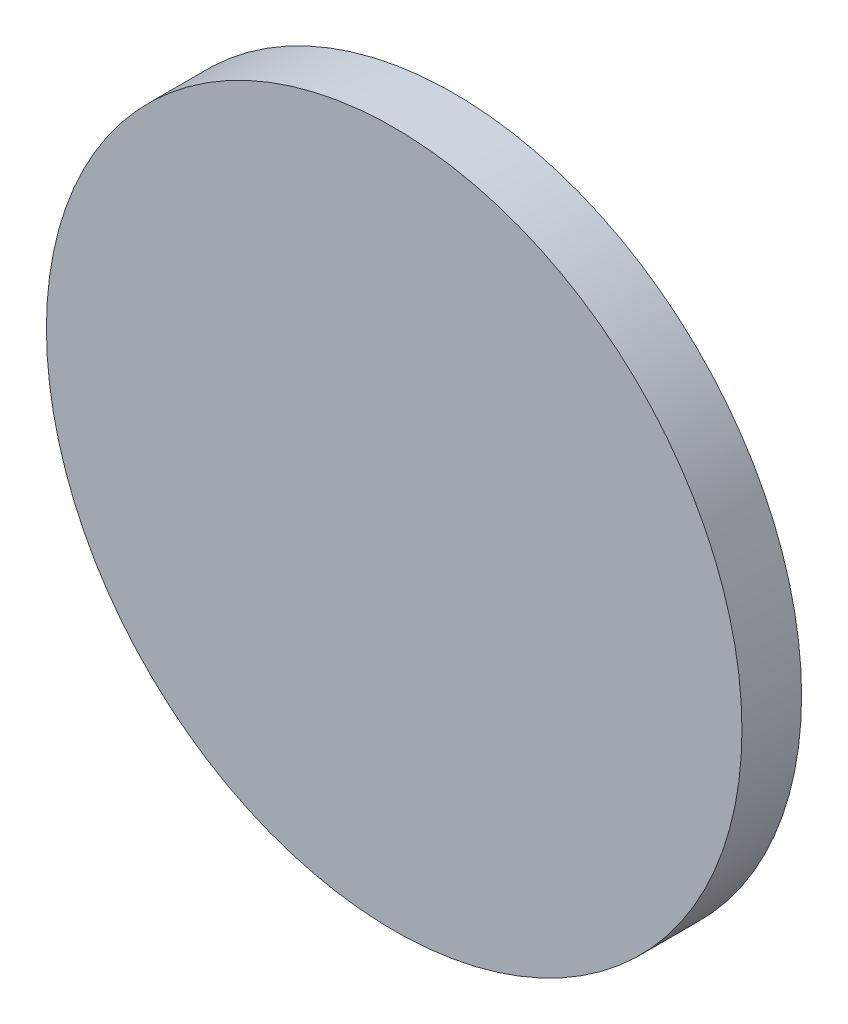
ISO-10303-21;
HEADER;
FILE_DESCRIPTION(('STEP AP214'),'2;1');
FILE_NAME('part.step','',(''),(''),'','','');
FILE_SCHEMA(('AUTOMOTIVE_DESIGN { 1 0 10303 214 1 1 1 1 }'));
ENDSEC;
DATA;
#1=APPLICATION_CONTEXT('core data for automotive mechanical design processes');
#2=APPLICATION_PROTOCOL_DEFINITION('international standard','automotive_design',2000,#1);
#3=PRODUCT_CONTEXT('',#1,'mechanical');
#4=PRODUCT('Part','Part','',(#3));
#5=PRODUCT_RELATED_PRODUCT_CATEGORY('part','',(#4));
#6=PRODUCT_DEFINITION_FORMATION('','',#4);
#7=PRODUCT_DEFINITION_CONTEXT('part definition',#1,'design');
#8=PRODUCT_DEFINITION('design','',#6,#7);
#9=PRODUCT_DEFINITION_SHAPE('','',#8);
#10=(LENGTH_UNIT() NAMED_UNIT(*) SI_UNIT(.MILLI.,.METRE.));
#11=(NAMED_UNIT(*) PLANE_ANGLE_UNIT() SI_UNIT($,.RADIAN.));
#12=(NAMED_UNIT(*) SI_UNIT($,.STERADIAN.) SOLID_ANGLE_UNIT());
#13=UNCERTAINTY_MEASURE_WITH_UNIT(LENGTH_MEASURE(1.E-05),#10,'distance_accuracy_value','');
#14=(GEOMETRIC_REPRESENTATION_CONTEXT(3) GLOBAL_UNCERTAINTY_ASSIGNED_CONTEXT((#13)) GLOBAL_UNIT_ASSIGNED_CONTEXT((#10,
#11,#12)) REPRESENTATION_CONTEXT('',''));
#15=CARTESIAN_POINT('',(0.,0.,0.));
#16=DIRECTION('',(0.,0.,1.));
#17=DIRECTION('',(1.,0.,0.));
#18=AXIS2_PLACEMENT_3D('',#15,#16,#17);
#19=CARTESIAN_POINT('',(7.9756,1.97358,0.76487));
#20=DIRECTION('',(0.,0.,-1.));
#21=DIRECTION('',(-1.,0.,0.));
#22=AXIS2_PLACEMENT_3D('',#19,#20,#21);
#23=PLANE('',#22);
#24=CARTESIAN_POINT('',(7.9756,1.97358,0.76487));
#25=DIRECTION('',(0.,0.,1.));
#26=DIRECTION('',(1.,0.,0.));
#27=AXIS2_PLACEMENT_3D('',#24,#25,#26);
#28=CIRCLE('',#27,0.200024667);
#29=CARTESIAN_POINT('',(8.175624667,1.97358,0.76487));
#30=VERTEX_POINT('',#29);
#31=EDGE_CURVE('E18',#30,#30,#28,.T.);
#32=ORIENTED_EDGE('',*,*,#31,.F.);
#33=EDGE_LOOP('',(#32));
#34=FACE_BOUND('',#33,.T.);
#35=ADVANCED_FACE('F15',(#34),#23,.T.);
#36=CARTESIAN_POINT('',(7.9756,1.97358,0.76487));
#37=DIRECTION('',(0.,0.,1.));
#38=DIRECTION('',(1.,0.,0.));
#39=AXIS2_PLACEMENT_3D('',#36,#37,#38);
#40=CYLINDRICAL_SURFACE('',#39,0.200024667);
#41=CARTESIAN_POINT('',(7.9756,1.97358,0.79916));
#42=DIRECTION('',(0.,0.,1.));
#43=DIRECTION('',(1.,0.,0.));
#44=AXIS2_PLACEMENT_3D('',#41,#42,#43);
#45=CIRCLE('',#44,0.200024667);
#46=CARTESIAN_POINT('',(8.175624667,1.97358,0.79916));
#47=VERTEX_POINT('',#46);
#48=EDGE_CURVE('E10',#47,#47,#45,.T.);
#49=ORIENTED_EDGE('',*,*,#48,.F.);
#50=EDGE_LOOP('',(#49));
#51=FACE_BOUND('',#50,.T.);
#52=ORIENTED_EDGE('',*,*,#31,.T.);
#53=EDGE_LOOP('',(#52));
#54=FACE_BOUND('',#53,.T.);
#55=ADVANCED_FACE('F27',(#51,#54),#40,.T.);
#56=CARTESIAN_POINT('',(7.9756,1.97358,0.79916));
#57=DIRECTION('',(0.,0.,1.));
#58=DIRECTION('',(1.,0.,0.));
#59=AXIS2_PLACEMENT_3D('',#56,#57,#58);
#60=PLANE('',#59);
#61=ORIENTED_EDGE('',*,*,#48,.T.);
#62=EDGE_LOOP('',(#61));
#63=FACE_BOUND('',#62,.T.);
#64=ADVANCED_FACE('F34',(#63),#60,.T.);
#65=CLOSED_SHELL('',(#35,#55,#64));
#66=MANIFOLD_SOLID_BREP('B1',#65);
#67=ADVANCED_BREP_SHAPE_REPRESENTATION('',(#18,#66),#14);
#68=SHAPE_DEFINITION_REPRESENTATION(#9,#67);
ENDSEC;
END-ISO-10303-21;
